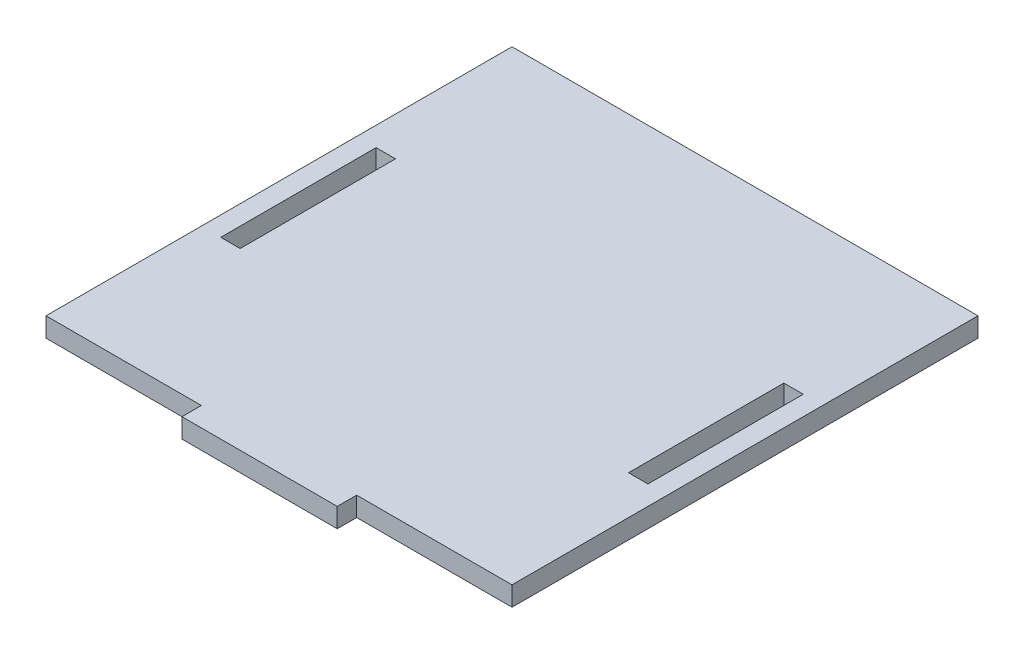
ISO-10303-21;
HEADER;
FILE_DESCRIPTION(('STEP AP214'),'2;1');
FILE_NAME('part.step','',(''),(''),'','','');
FILE_SCHEMA(('AUTOMOTIVE_DESIGN { 1 0 10303 214 1 1 1 1 }'));
ENDSEC;
DATA;
#1=APPLICATION_CONTEXT('core data for automotive mechanical design processes');
#2=APPLICATION_PROTOCOL_DEFINITION('international standard','automotive_design',2000,#1);
#3=PRODUCT_CONTEXT('',#1,'mechanical');
#4=PRODUCT('Part','Part','',(#3));
#5=PRODUCT_RELATED_PRODUCT_CATEGORY('part','',(#4));
#6=PRODUCT_DEFINITION_FORMATION('','',#4);
#7=PRODUCT_DEFINITION_CONTEXT('part definition',#1,'design');
#8=PRODUCT_DEFINITION('design','',#6,#7);
#9=PRODUCT_DEFINITION_SHAPE('','',#8);
#10=(LENGTH_UNIT() NAMED_UNIT(*) SI_UNIT(.MILLI.,.METRE.));
#11=(NAMED_UNIT(*) PLANE_ANGLE_UNIT() SI_UNIT($,.RADIAN.));
#12=(NAMED_UNIT(*) SI_UNIT($,.STERADIAN.) SOLID_ANGLE_UNIT());
#13=UNCERTAINTY_MEASURE_WITH_UNIT(LENGTH_MEASURE(1.E-05),#10,'distance_accuracy_value','');
#14=(GEOMETRIC_REPRESENTATION_CONTEXT(3) GLOBAL_UNCERTAINTY_ASSIGNED_CONTEXT((#13)) GLOBAL_UNIT_ASSIGNED_CONTEXT((#10,
#11,#12)) REPRESENTATION_CONTEXT('',''));
#15=CARTESIAN_POINT('',(0.,0.,0.));
#16=DIRECTION('',(0.,0.,1.));
#17=DIRECTION('',(1.,0.,0.));
#18=AXIS2_PLACEMENT_3D('',#15,#16,#17);
#19=CARTESIAN_POINT('',(0.,6.35,-28.575));
#20=DIRECTION('',(0.,0.,1.));
#21=DIRECTION('',(1.,0.,0.));
#22=AXIS2_PLACEMENT_3D('',#19,#20,#21);
#23=PLANE('',#22);
#24=DIRECTION('',(-1.,0.,0.));
#25=VECTOR('',#24,1.);
#26=CARTESIAN_POINT('',(0.,0.,-28.575));
#27=LINE('',#26,#25);
#28=CARTESIAN_POINT('',(69.8500000000001,0.,-28.575));
#29=VERTEX_POINT('',#28);
#30=CARTESIAN_POINT('',(63.5000000000001,0.,-28.575));
#31=VERTEX_POINT('',#30);
#32=EDGE_CURVE('E286',#29,#31,#27,.T.);
#33=ORIENTED_EDGE('',*,*,#32,.F.);
#34=DIRECTION('',(0.,-1.,0.));
#35=VECTOR('',#34,1.);
#36=CARTESIAN_POINT('',(69.8500000000001,6.35,-28.575));
#37=LINE('',#36,#35);
#38=CARTESIAN_POINT('',(69.8500000000001,6.35,-28.575));
#39=VERTEX_POINT('',#38);
#40=EDGE_CURVE('E11',#39,#29,#37,.T.);
#41=ORIENTED_EDGE('',*,*,#40,.F.);
#42=DIRECTION('',(-1.,0.,0.));
#43=VECTOR('',#42,1.);
#44=CARTESIAN_POINT('',(0.,6.35,-28.575));
#45=LINE('',#44,#43);
#46=CARTESIAN_POINT('',(63.5000000000001,6.35,-28.575));
#47=VERTEX_POINT('',#46);
#48=EDGE_CURVE('E176',#39,#47,#45,.T.);
#49=ORIENTED_EDGE('',*,*,#48,.T.);
#50=DIRECTION('',(0.,-1.,0.));
#51=VECTOR('',#50,1.);
#52=CARTESIAN_POINT('',(63.5000000000001,6.35,-28.575));
#53=LINE('',#52,#51);
#54=EDGE_CURVE('E61',#47,#31,#53,.T.);
#55=ORIENTED_EDGE('',*,*,#54,.T.);
#56=EDGE_LOOP('',(#33,#41,#49,#55));
#57=FACE_BOUND('',#56,.T.);
#58=ADVANCED_FACE('F41',(#57),#23,.T.);
#59=CARTESIAN_POINT('',(69.8500000000001,6.35,0.));
#60=DIRECTION('',(1.,0.,0.));
#61=DIRECTION('',(0.,0.,-1.));
#62=AXIS2_PLACEMENT_3D('',#59,#60,#61);
#63=PLANE('',#62);
#64=DIRECTION('',(0.,0.,1.));
#65=VECTOR('',#64,1.);
#66=CARTESIAN_POINT('',(69.8500000000001,0.,0.));
#67=LINE('',#66,#65);
#68=CARTESIAN_POINT('',(69.8500000000001,0.,22.2249999999999));
#69=VERTEX_POINT('',#68);
#70=EDGE_CURVE('E182',#29,#69,#67,.T.);
#71=ORIENTED_EDGE('',*,*,#70,.T.);
#72=DIRECTION('',(0.,-1.,0.));
#73=VECTOR('',#72,1.);
#74=CARTESIAN_POINT('',(69.8500000000001,6.35,22.2249999999999));
#75=LINE('',#74,#73);
#76=CARTESIAN_POINT('',(69.8500000000001,6.35,22.2249999999999));
#77=VERTEX_POINT('',#76);
#78=EDGE_CURVE('E52',#77,#69,#75,.T.);
#79=ORIENTED_EDGE('',*,*,#78,.F.);
#80=DIRECTION('',(0.,0.,1.));
#81=VECTOR('',#80,1.);
#82=CARTESIAN_POINT('',(69.8500000000001,6.35,0.));
#83=LINE('',#82,#81);
#84=EDGE_CURVE('E171',#39,#77,#83,.T.);
#85=ORIENTED_EDGE('',*,*,#84,.F.);
#86=ORIENTED_EDGE('',*,*,#40,.T.);
#87=EDGE_LOOP('',(#71,#79,#85,#86));
#88=FACE_BOUND('',#87,.T.);
#89=ADVANCED_FACE('F180',(#88),#63,.F.);
#90=CARTESIAN_POINT('',(0.,6.35,22.2249999999999));
#91=DIRECTION('',(0.,0.,1.));
#92=DIRECTION('',(1.,0.,0.));
#93=AXIS2_PLACEMENT_3D('',#90,#91,#92);
#94=PLANE('',#93);
#95=DIRECTION('',(-1.,0.,0.));
#96=VECTOR('',#95,1.);
#97=CARTESIAN_POINT('',(0.,0.,22.2249999999999));
#98=LINE('',#97,#96);
#99=CARTESIAN_POINT('',(63.5000000000001,0.,22.2249999999999));
#100=VERTEX_POINT('',#99);
#101=EDGE_CURVE('E291',#69,#100,#98,.T.);
#102=ORIENTED_EDGE('',*,*,#101,.T.);
#103=DIRECTION('',(0.,-1.,0.));
#104=VECTOR('',#103,1.);
#105=CARTESIAN_POINT('',(63.5000000000001,6.35,22.2249999999999));
#106=LINE('',#105,#104);
#107=CARTESIAN_POINT('',(63.5000000000001,6.35,22.2249999999999));
#108=VERTEX_POINT('',#107);
#109=EDGE_CURVE('E111',#108,#100,#106,.T.);
#110=ORIENTED_EDGE('',*,*,#109,.F.);
#111=DIRECTION('',(-1.,0.,0.));
#112=VECTOR('',#111,1.);
#113=CARTESIAN_POINT('',(0.,6.35,22.2249999999999));
#114=LINE('',#113,#112);
#115=EDGE_CURVE('E162',#77,#108,#114,.T.);
#116=ORIENTED_EDGE('',*,*,#115,.F.);
#117=ORIENTED_EDGE('',*,*,#78,.T.);
#118=EDGE_LOOP('',(#102,#110,#116,#117));
#119=FACE_BOUND('',#118,.T.);
#120=ADVANCED_FACE('F164',(#119),#94,.F.);
#121=CARTESIAN_POINT('',(0.,6.35,-28.575));
#122=DIRECTION('',(0.,0.,-1.));
#123=DIRECTION('',(-1.,0.,0.));
#124=AXIS2_PLACEMENT_3D('',#121,#122,#123);
#125=PLANE('',#124);
#126=DIRECTION('',(1.,0.,0.));
#127=VECTOR('',#126,1.);
#128=CARTESIAN_POINT('',(0.,0.,-28.575));
#129=LINE('',#128,#127);
#130=CARTESIAN_POINT('',(-69.85,0.,-28.575));
#131=VERTEX_POINT('',#130);
#132=CARTESIAN_POINT('',(-63.5,0.,-28.575));
#133=VERTEX_POINT('',#132);
#134=EDGE_CURVE('E270',#131,#133,#129,.T.);
#135=ORIENTED_EDGE('',*,*,#134,.T.);
#136=DIRECTION('',(0.,-1.,0.));
#137=VECTOR('',#136,1.);
#138=CARTESIAN_POINT('',(-63.5,6.35,-28.575));
#139=LINE('',#138,#137);
#140=CARTESIAN_POINT('',(-63.5,6.35,-28.575));
#141=VERTEX_POINT('',#140);
#142=EDGE_CURVE('E198',#141,#133,#139,.T.);
#143=ORIENTED_EDGE('',*,*,#142,.F.);
#144=DIRECTION('',(1.,0.,0.));
#145=VECTOR('',#144,1.);
#146=CARTESIAN_POINT('',(0.,6.35,-28.575));
#147=LINE('',#146,#145);
#148=CARTESIAN_POINT('',(-69.85,6.35,-28.575));
#149=VERTEX_POINT('',#148);
#150=EDGE_CURVE('E326',#149,#141,#147,.T.);
#151=ORIENTED_EDGE('',*,*,#150,.F.);
#152=DIRECTION('',(0.,-1.,0.));
#153=VECTOR('',#152,1.);
#154=CARTESIAN_POINT('',(-69.85,6.35,-28.575));
#155=LINE('',#154,#153);
#156=EDGE_CURVE('E189',#149,#131,#155,.T.);
#157=ORIENTED_EDGE('',*,*,#156,.T.);
#158=EDGE_LOOP('',(#135,#143,#151,#157));
#159=FACE_BOUND('',#158,.T.);
#160=ADVANCED_FACE('F376',(#159),#125,.F.);
#161=CARTESIAN_POINT('',(-63.5,6.35,0.));
#162=DIRECTION('',(1.,0.,0.));
#163=DIRECTION('',(0.,0.,-1.));
#164=AXIS2_PLACEMENT_3D('',#161,#162,#163);
#165=PLANE('',#164);
#166=DIRECTION('',(0.,0.,1.));
#167=VECTOR('',#166,1.);
#168=CARTESIAN_POINT('',(-63.5,0.,0.));
#169=LINE('',#168,#167);
#170=CARTESIAN_POINT('',(-63.5,0.,22.225));
#171=VERTEX_POINT('',#170);
#172=EDGE_CURVE('E274',#133,#171,#169,.T.);
#173=ORIENTED_EDGE('',*,*,#172,.T.);
#174=DIRECTION('',(0.,-1.,0.));
#175=VECTOR('',#174,1.);
#176=CARTESIAN_POINT('',(-63.5,6.35,22.225));
#177=LINE('',#176,#175);
#178=CARTESIAN_POINT('',(-63.5,6.35,22.225));
#179=VERTEX_POINT('',#178);
#180=EDGE_CURVE('E195',#179,#171,#177,.T.);
#181=ORIENTED_EDGE('',*,*,#180,.F.);
#182=DIRECTION('',(0.,0.,1.));
#183=VECTOR('',#182,1.);
#184=CARTESIAN_POINT('',(-63.5,6.35,0.));
#185=LINE('',#184,#183);
#186=EDGE_CURVE('E330',#141,#179,#185,.T.);
#187=ORIENTED_EDGE('',*,*,#186,.F.);
#188=ORIENTED_EDGE('',*,*,#142,.T.);
#189=EDGE_LOOP('',(#173,#181,#187,#188));
#190=FACE_BOUND('',#189,.T.);
#191=ADVANCED_FACE('F372',(#190),#165,.F.);
#192=CARTESIAN_POINT('',(0.,6.35,22.225));
#193=DIRECTION('',(0.,0.,-1.));
#194=DIRECTION('',(-1.,0.,0.));
#195=AXIS2_PLACEMENT_3D('',#192,#193,#194);
#196=PLANE('',#195);
#197=DIRECTION('',(1.,0.,0.));
#198=VECTOR('',#197,1.);
#199=CARTESIAN_POINT('',(0.,0.,22.225));
#200=LINE('',#199,#198);
#201=CARTESIAN_POINT('',(-69.85,0.,22.225));
#202=VERTEX_POINT('',#201);
#203=EDGE_CURVE('E278',#202,#171,#200,.T.);
#204=ORIENTED_EDGE('',*,*,#203,.F.);
#205=DIRECTION('',(0.,-1.,0.));
#206=VECTOR('',#205,1.);
#207=CARTESIAN_POINT('',(-69.85,6.35,22.225));
#208=LINE('',#207,#206);
#209=CARTESIAN_POINT('',(-69.85,6.35,22.225));
#210=VERTEX_POINT('',#209);
#211=EDGE_CURVE('E192',#210,#202,#208,.T.);
#212=ORIENTED_EDGE('',*,*,#211,.F.);
#213=DIRECTION('',(1.,0.,0.));
#214=VECTOR('',#213,1.);
#215=CARTESIAN_POINT('',(0.,6.35,22.225));
#216=LINE('',#215,#214);
#217=EDGE_CURVE('E333',#210,#179,#216,.T.);
#218=ORIENTED_EDGE('',*,*,#217,.T.);
#219=ORIENTED_EDGE('',*,*,#180,.T.);
#220=EDGE_LOOP('',(#204,#212,#218,#219));
#221=FACE_BOUND('',#220,.T.);
#222=ADVANCED_FACE('F369',(#221),#196,.T.);
#223=CARTESIAN_POINT('',(0.,6.35,79.375));
#224=DIRECTION('',(0.,0.,1.));
#225=DIRECTION('',(1.,0.,0.));
#226=AXIS2_PLACEMENT_3D('',#223,#224,#225);
#227=PLANE('',#226);
#228=DIRECTION('',(-1.,0.,0.));
#229=VECTOR('',#228,1.);
#230=CARTESIAN_POINT('',(0.,0.,79.375));
#231=LINE('',#230,#229);
#232=CARTESIAN_POINT('',(25.4000000000001,0.,79.375));
#233=VERTEX_POINT('',#232);
#234=CARTESIAN_POINT('',(-25.4,0.,79.375));
#235=VERTEX_POINT('',#234);
#236=EDGE_CURVE('E240',#233,#235,#231,.T.);
#237=ORIENTED_EDGE('',*,*,#236,.F.);
#238=DIRECTION('',(0.,-1.,0.));
#239=VECTOR('',#238,1.);
#240=CARTESIAN_POINT('',(25.4000000000001,6.35,79.375));
#241=LINE('',#240,#239);
#242=CARTESIAN_POINT('',(25.4000000000001,6.35,79.375));
#243=VERTEX_POINT('',#242);
#244=EDGE_CURVE('E45',#243,#233,#241,.T.);
#245=ORIENTED_EDGE('',*,*,#244,.F.);
#246=DIRECTION('',(-1.,0.,0.));
#247=VECTOR('',#246,1.);
#248=CARTESIAN_POINT('',(0.,6.35,79.375));
#249=LINE('',#248,#247);
#250=CARTESIAN_POINT('',(-25.4,6.35,79.375));
#251=VERTEX_POINT('',#250);
#252=EDGE_CURVE('E297',#243,#251,#249,.T.);
#253=ORIENTED_EDGE('',*,*,#252,.T.);
#254=DIRECTION('',(0.,-1.,0.));
#255=VECTOR('',#254,1.);
#256=CARTESIAN_POINT('',(-25.4,6.35,79.375));
#257=LINE('',#256,#255);
#258=EDGE_CURVE('E202',#251,#235,#257,.T.);
#259=ORIENTED_EDGE('',*,*,#258,.T.);
#260=EDGE_LOOP('',(#237,#245,#253,#259));
#261=FACE_BOUND('',#260,.T.);
#262=ADVANCED_FACE('F43',(#261),#227,.T.);
#263=CARTESIAN_POINT('',(25.4000000000002,6.35,0.));
#264=DIRECTION('',(-1.,0.,0.));
#265=DIRECTION('',(0.,0.,1.));
#266=AXIS2_PLACEMENT_3D('',#263,#264,#265);
#267=PLANE('',#266);
#268=DIRECTION('',(0.,0.,-1.));
#269=VECTOR('',#268,1.);
#270=CARTESIAN_POINT('',(25.4000000000002,0.,0.));
#271=LINE('',#270,#269);
#272=CARTESIAN_POINT('',(25.4000000000001,0.,73.0249999999999));
#273=VERTEX_POINT('',#272);
#274=EDGE_CURVE('E231',#233,#273,#271,.T.);
#275=ORIENTED_EDGE('',*,*,#274,.T.);
#276=DIRECTION('',(0.,-1.,0.));
#277=VECTOR('',#276,1.);
#278=CARTESIAN_POINT('',(25.4000000000001,6.35,73.0249999999999));
#279=LINE('',#278,#277);
#280=CARTESIAN_POINT('',(25.4000000000001,6.35,73.0249999999999));
#281=VERTEX_POINT('',#280);
#282=EDGE_CURVE('E220',#281,#273,#279,.T.);
#283=ORIENTED_EDGE('',*,*,#282,.F.);
#284=DIRECTION('',(0.,0.,-1.));
#285=VECTOR('',#284,1.);
#286=CARTESIAN_POINT('',(25.4000000000002,6.35,0.));
#287=LINE('',#286,#285);
#288=EDGE_CURVE('E233',#243,#281,#287,.T.);
#289=ORIENTED_EDGE('',*,*,#288,.F.);
#290=ORIENTED_EDGE('',*,*,#244,.T.);
#291=EDGE_LOOP('',(#275,#283,#289,#290));
#292=FACE_BOUND('',#291,.T.);
#293=ADVANCED_FACE('F230',(#292),#267,.F.);
#294=CARTESIAN_POINT('',(0.,6.35,73.0249999999999));
#295=DIRECTION('',(0.,0.,1.));
#296=DIRECTION('',(1.,0.,0.));
#297=AXIS2_PLACEMENT_3D('',#294,#295,#296);
#298=PLANE('',#297);
#299=DIRECTION('',(-1.,0.,0.));
#300=VECTOR('',#299,1.);
#301=CARTESIAN_POINT('',(0.,0.,73.0249999999999));
#302=LINE('',#301,#300);
#303=CARTESIAN_POINT('',(76.2,0.,73.0249999999999));
#304=VERTEX_POINT('',#303);
#305=EDGE_CURVE('E243',#304,#273,#302,.T.);
#306=ORIENTED_EDGE('',*,*,#305,.F.);
#307=DIRECTION('',(0.,-1.,0.));
#308=VECTOR('',#307,1.);
#309=CARTESIAN_POINT('',(76.2,6.35,73.0249999999999));
#310=LINE('',#309,#308);
#311=CARTESIAN_POINT('',(76.2,6.35,73.0249999999999));
#312=VERTEX_POINT('',#311);
#313=EDGE_CURVE('E218',#312,#304,#310,.T.);
#314=ORIENTED_EDGE('',*,*,#313,.F.);
#315=DIRECTION('',(-1.,0.,0.));
#316=VECTOR('',#315,1.);
#317=CARTESIAN_POINT('',(0.,6.35,73.0249999999999));
#318=LINE('',#317,#316);
#319=EDGE_CURVE('E304',#312,#281,#318,.T.);
#320=ORIENTED_EDGE('',*,*,#319,.T.);
#321=ORIENTED_EDGE('',*,*,#282,.T.);
#322=EDGE_LOOP('',(#306,#314,#320,#321));
#323=FACE_BOUND('',#322,.T.);
#324=ADVANCED_FACE('F395',(#323),#298,.T.);
#325=CARTESIAN_POINT('',(76.2,6.35,0.));
#326=DIRECTION('',(-1.,0.,0.));
#327=DIRECTION('',(0.,0.,1.));
#328=AXIS2_PLACEMENT_3D('',#325,#326,#327);
#329=PLANE('',#328);
#330=DIRECTION('',(0.,0.,-1.));
#331=VECTOR('',#330,1.);
#332=CARTESIAN_POINT('',(76.2,0.,0.));
#333=LINE('',#332,#331);
#334=CARTESIAN_POINT('',(76.2,0.,-79.375));
#335=VERTEX_POINT('',#334);
#336=EDGE_CURVE('E252',#304,#335,#333,.T.);
#337=ORIENTED_EDGE('',*,*,#336,.T.);
#338=DIRECTION('',(0.,-1.,0.));
#339=VECTOR('',#338,1.);
#340=CARTESIAN_POINT('',(76.2,6.35,-79.375));
#341=LINE('',#340,#339);
#342=CARTESIAN_POINT('',(76.2,6.35,-79.375));
#343=VERTEX_POINT('',#342);
#344=EDGE_CURVE('E214',#343,#335,#341,.T.);
#345=ORIENTED_EDGE('',*,*,#344,.F.);
#346=DIRECTION('',(0.,0.,-1.));
#347=VECTOR('',#346,1.);
#348=CARTESIAN_POINT('',(76.2,6.35,0.));
#349=LINE('',#348,#347);
#350=EDGE_CURVE('E309',#312,#343,#349,.T.);
#351=ORIENTED_EDGE('',*,*,#350,.F.);
#352=ORIENTED_EDGE('',*,*,#313,.T.);
#353=EDGE_LOOP('',(#337,#345,#351,#352));
#354=FACE_BOUND('',#353,.T.);
#355=ADVANCED_FACE('F391',(#354),#329,.F.);
#356=CARTESIAN_POINT('',(0.,6.35,-79.375));
#357=DIRECTION('',(0.,0.,1.));
#358=DIRECTION('',(1.,0.,0.));
#359=AXIS2_PLACEMENT_3D('',#356,#357,#358);
#360=PLANE('',#359);
#361=DIRECTION('',(-1.,0.,0.));
#362=VECTOR('',#361,1.);
#363=CARTESIAN_POINT('',(0.,0.,-79.375));
#364=LINE('',#363,#362);
#365=CARTESIAN_POINT('',(-76.2,0.,-79.375));
#366=VERTEX_POINT('',#365);
#367=EDGE_CURVE('E255',#335,#366,#364,.T.);
#368=ORIENTED_EDGE('',*,*,#367,.T.);
#369=DIRECTION('',(0.,-1.,0.));
#370=VECTOR('',#369,1.);
#371=CARTESIAN_POINT('',(-76.2,6.35,-79.375));
#372=LINE('',#371,#370);
#373=CARTESIAN_POINT('',(-76.2,6.35,-79.375));
#374=VERTEX_POINT('',#373);
#375=EDGE_CURVE('E211',#374,#366,#372,.T.);
#376=ORIENTED_EDGE('',*,*,#375,.F.);
#377=DIRECTION('',(-1.,0.,0.));
#378=VECTOR('',#377,1.);
#379=CARTESIAN_POINT('',(0.,6.35,-79.375));
#380=LINE('',#379,#378);
#381=EDGE_CURVE('E312',#343,#374,#380,.T.);
#382=ORIENTED_EDGE('',*,*,#381,.F.);
#383=ORIENTED_EDGE('',*,*,#344,.T.);
#384=EDGE_LOOP('',(#368,#376,#382,#383));
#385=FACE_BOUND('',#384,.T.);
#386=ADVANCED_FACE('F387',(#385),#360,.F.);
#387=CARTESIAN_POINT('',(-76.2,6.35,0.));
#388=DIRECTION('',(-1.,0.,0.));
#389=DIRECTION('',(0.,0.,1.));
#390=AXIS2_PLACEMENT_3D('',#387,#388,#389);
#391=PLANE('',#390);
#392=DIRECTION('',(0.,0.,-1.));
#393=VECTOR('',#392,1.);
#394=CARTESIAN_POINT('',(-76.2,0.,0.));
#395=LINE('',#394,#393);
#396=CARTESIAN_POINT('',(-76.2,0.,73.025));
#397=VERTEX_POINT('',#396);
#398=EDGE_CURVE('E259',#397,#366,#395,.T.);
#399=ORIENTED_EDGE('',*,*,#398,.F.);
#400=DIRECTION('',(0.,-1.,0.));
#401=VECTOR('',#400,1.);
#402=CARTESIAN_POINT('',(-76.2,6.35,73.025));
#403=LINE('',#402,#401);
#404=CARTESIAN_POINT('',(-76.2,6.35,73.025));
#405=VERTEX_POINT('',#404);
#406=EDGE_CURVE('E208',#405,#397,#403,.T.);
#407=ORIENTED_EDGE('',*,*,#406,.F.);
#408=DIRECTION('',(0.,0.,-1.));
#409=VECTOR('',#408,1.);
#410=CARTESIAN_POINT('',(-76.2,6.35,0.));
#411=LINE('',#410,#409);
#412=EDGE_CURVE('E315',#405,#374,#411,.T.);
#413=ORIENTED_EDGE('',*,*,#412,.T.);
#414=ORIENTED_EDGE('',*,*,#375,.T.);
#415=EDGE_LOOP('',(#399,#407,#413,#414));
#416=FACE_BOUND('',#415,.T.);
#417=ADVANCED_FACE('F383',(#416),#391,.T.);
#418=CARTESIAN_POINT('',(0.,6.35,73.025));
#419=DIRECTION('',(0.,0.,-1.));
#420=DIRECTION('',(-1.,0.,0.));
#421=AXIS2_PLACEMENT_3D('',#418,#419,#420);
#422=PLANE('',#421);
#423=DIRECTION('',(1.,0.,0.));
#424=VECTOR('',#423,1.);
#425=CARTESIAN_POINT('',(0.,0.,73.025));
#426=LINE('',#425,#424);
#427=CARTESIAN_POINT('',(-25.4,0.,73.025));
#428=VERTEX_POINT('',#427);
#429=EDGE_CURVE('E263',#397,#428,#426,.T.);
#430=ORIENTED_EDGE('',*,*,#429,.T.);
#431=DIRECTION('',(0.,-1.,0.));
#432=VECTOR('',#431,1.);
#433=CARTESIAN_POINT('',(-25.4,6.35,73.025));
#434=LINE('',#433,#432);
#435=CARTESIAN_POINT('',(-25.4,6.35,73.025));
#436=VERTEX_POINT('',#435);
#437=EDGE_CURVE('E205',#436,#428,#434,.T.);
#438=ORIENTED_EDGE('',*,*,#437,.F.);
#439=DIRECTION('',(1.,0.,0.));
#440=VECTOR('',#439,1.);
#441=CARTESIAN_POINT('',(0.,6.35,73.025));
#442=LINE('',#441,#440);
#443=EDGE_CURVE('E319',#405,#436,#442,.T.);
#444=ORIENTED_EDGE('',*,*,#443,.F.);
#445=ORIENTED_EDGE('',*,*,#406,.T.);
#446=EDGE_LOOP('',(#430,#438,#444,#445));
#447=FACE_BOUND('',#446,.T.);
#448=ADVANCED_FACE('F367',(#447),#422,.F.);
#449=CARTESIAN_POINT('',(-69.85,6.35,0.));
#450=DIRECTION('',(1.,0.,0.));
#451=DIRECTION('',(0.,0.,-1.));
#452=AXIS2_PLACEMENT_3D('',#449,#450,#451);
#453=PLANE('',#452);
#454=DIRECTION('',(0.,0.,1.));
#455=VECTOR('',#454,1.);
#456=CARTESIAN_POINT('',(-69.85,0.,0.));
#457=LINE('',#456,#455);
#458=EDGE_CURVE('E282',#131,#202,#457,.T.);
#459=ORIENTED_EDGE('',*,*,#458,.F.);
#460=ORIENTED_EDGE('',*,*,#156,.F.);
#461=DIRECTION('',(0.,0.,1.));
#462=VECTOR('',#461,1.);
#463=CARTESIAN_POINT('',(-69.85,6.35,0.));
#464=LINE('',#463,#462);
#465=EDGE_CURVE('E337',#149,#210,#464,.T.);
#466=ORIENTED_EDGE('',*,*,#465,.T.);
#467=ORIENTED_EDGE('',*,*,#211,.T.);
#468=EDGE_LOOP('',(#459,#460,#466,#467));
#469=FACE_BOUND('',#468,.T.);
#470=ADVANCED_FACE('F353',(#469),#453,.T.);
#471=CARTESIAN_POINT('',(-25.4000000000002,6.35,0.));
#472=DIRECTION('',(-1.,0.,0.));
#473=DIRECTION('',(0.,0.,1.));
#474=AXIS2_PLACEMENT_3D('',#471,#472,#473);
#475=PLANE('',#474);
#476=DIRECTION('',(0.,0.,-1.));
#477=VECTOR('',#476,1.);
#478=CARTESIAN_POINT('',(-25.4000000000002,0.,0.));
#479=LINE('',#478,#477);
#480=EDGE_CURVE('E267',#235,#428,#479,.T.);
#481=ORIENTED_EDGE('',*,*,#480,.F.);
#482=ORIENTED_EDGE('',*,*,#258,.F.);
#483=DIRECTION('',(0.,0.,-1.));
#484=VECTOR('',#483,1.);
#485=CARTESIAN_POINT('',(-25.4000000000002,6.35,0.));
#486=LINE('',#485,#484);
#487=EDGE_CURVE('E322',#251,#436,#486,.T.);
#488=ORIENTED_EDGE('',*,*,#487,.T.);
#489=ORIENTED_EDGE('',*,*,#437,.T.);
#490=EDGE_LOOP('',(#481,#482,#488,#489));
#491=FACE_BOUND('',#490,.T.);
#492=ADVANCED_FACE('F345',(#491),#475,.T.);
#493=CARTESIAN_POINT('',(63.5000000000001,6.35,0.));
#494=DIRECTION('',(1.,0.,0.));
#495=DIRECTION('',(0.,0.,-1.));
#496=AXIS2_PLACEMENT_3D('',#493,#494,#495);
#497=PLANE('',#496);
#498=DIRECTION('',(0.,0.,1.));
#499=VECTOR('',#498,1.);
#500=CARTESIAN_POINT('',(63.5000000000001,0.,0.));
#501=LINE('',#500,#499);
#502=EDGE_CURVE('E294',#31,#100,#501,.T.);
#503=ORIENTED_EDGE('',*,*,#502,.F.);
#504=ORIENTED_EDGE('',*,*,#54,.F.);
#505=DIRECTION('',(0.,0.,1.));
#506=VECTOR('',#505,1.);
#507=CARTESIAN_POINT('',(63.5000000000001,6.35,0.));
#508=LINE('',#507,#506);
#509=EDGE_CURVE('E170',#47,#108,#508,.T.);
#510=ORIENTED_EDGE('',*,*,#509,.T.);
#511=ORIENTED_EDGE('',*,*,#109,.T.);
#512=EDGE_LOOP('',(#503,#504,#510,#511));
#513=FACE_BOUND('',#512,.T.);
#514=ADVANCED_FACE('F343',(#513),#497,.T.);
#515=CARTESIAN_POINT('',(0.,6.35,0.));
#516=DIRECTION('',(0.,1.,0.));
#517=DIRECTION('',(0.,0.,1.));
#518=AXIS2_PLACEMENT_3D('',#515,#516,#517);
#519=PLANE('',#518);
#520=ORIENTED_EDGE('',*,*,#252,.F.);
#521=ORIENTED_EDGE('',*,*,#288,.T.);
#522=ORIENTED_EDGE('',*,*,#319,.F.);
#523=ORIENTED_EDGE('',*,*,#350,.T.);
#524=ORIENTED_EDGE('',*,*,#381,.T.);
#525=ORIENTED_EDGE('',*,*,#412,.F.);
#526=ORIENTED_EDGE('',*,*,#443,.T.);
#527=ORIENTED_EDGE('',*,*,#487,.F.);
#528=EDGE_LOOP('',(#520,#521,#522,#523,#524,#525,#526,#527));
#529=FACE_BOUND('',#528,.T.);
#530=ORIENTED_EDGE('',*,*,#150,.T.);
#531=ORIENTED_EDGE('',*,*,#186,.T.);
#532=ORIENTED_EDGE('',*,*,#217,.F.);
#533=ORIENTED_EDGE('',*,*,#465,.F.);
#534=EDGE_LOOP('',(#530,#531,#532,#533));
#535=FACE_BOUND('',#534,.T.);
#536=ORIENTED_EDGE('',*,*,#48,.F.);
#537=ORIENTED_EDGE('',*,*,#84,.T.);
#538=ORIENTED_EDGE('',*,*,#115,.T.);
#539=ORIENTED_EDGE('',*,*,#509,.F.);
#540=EDGE_LOOP('',(#536,#537,#538,#539));
#541=FACE_BOUND('',#540,.T.);
#542=ADVANCED_FACE('F175',(#529,#535,#541),#519,.T.);
#543=CARTESIAN_POINT('',(0.,0.,0.));
#544=DIRECTION('',(0.,1.,0.));
#545=DIRECTION('',(0.,0.,1.));
#546=AXIS2_PLACEMENT_3D('',#543,#544,#545);
#547=PLANE('',#546);
#548=ORIENTED_EDGE('',*,*,#236,.T.);
#549=ORIENTED_EDGE('',*,*,#480,.T.);
#550=ORIENTED_EDGE('',*,*,#429,.F.);
#551=ORIENTED_EDGE('',*,*,#398,.T.);
#552=ORIENTED_EDGE('',*,*,#367,.F.);
#553=ORIENTED_EDGE('',*,*,#336,.F.);
#554=ORIENTED_EDGE('',*,*,#305,.T.);
#555=ORIENTED_EDGE('',*,*,#274,.F.);
#556=EDGE_LOOP('',(#548,#549,#550,#551,#552,#553,#554,#555));
#557=FACE_BOUND('',#556,.T.);
#558=ORIENTED_EDGE('',*,*,#134,.F.);
#559=ORIENTED_EDGE('',*,*,#458,.T.);
#560=ORIENTED_EDGE('',*,*,#203,.T.);
#561=ORIENTED_EDGE('',*,*,#172,.F.);
#562=EDGE_LOOP('',(#558,#559,#560,#561));
#563=FACE_BOUND('',#562,.T.);
#564=ORIENTED_EDGE('',*,*,#32,.T.);
#565=ORIENTED_EDGE('',*,*,#502,.T.);
#566=ORIENTED_EDGE('',*,*,#101,.F.);
#567=ORIENTED_EDGE('',*,*,#70,.F.);
#568=EDGE_LOOP('',(#564,#565,#566,#567));
#569=FACE_BOUND('',#568,.T.);
#570=ADVANCED_FACE('F237',(#557,#563,#569),#547,.F.);
#571=CLOSED_SHELL('',(#58,#89,#120,#160,#191,#222,#262,#293,#324,#355,#386,#417,#448,#470,#492,
#514,#542,#570));
#572=MANIFOLD_SOLID_BREP('B2',#571);
#573=ADVANCED_BREP_SHAPE_REPRESENTATION('',(#18,#572),#14);
#574=SHAPE_DEFINITION_REPRESENTATION(#9,#573);
ENDSEC;
END-ISO-10303-21;
